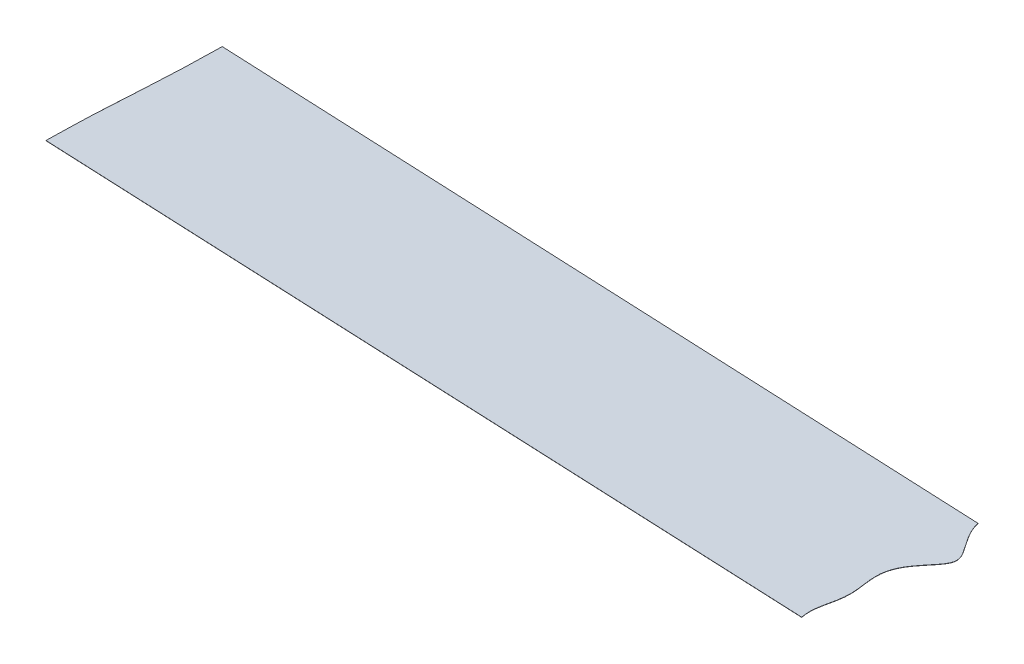
ISO-10303-21;
HEADER;
FILE_DESCRIPTION(('STEP AP214'),'2;1');
FILE_NAME('part.step','',(''),(''),'','','');
FILE_SCHEMA(('AUTOMOTIVE_DESIGN { 1 0 10303 214 1 1 1 1 }'));
ENDSEC;
DATA;
#1=APPLICATION_CONTEXT('core data for automotive mechanical design processes');
#2=APPLICATION_PROTOCOL_DEFINITION('international standard','automotive_design',2000,#1);
#3=PRODUCT_CONTEXT('',#1,'mechanical');
#4=PRODUCT('Part','Part','',(#3));
#5=PRODUCT_RELATED_PRODUCT_CATEGORY('part','',(#4));
#6=PRODUCT_DEFINITION_FORMATION('','',#4);
#7=PRODUCT_DEFINITION_CONTEXT('part definition',#1,'design');
#8=PRODUCT_DEFINITION('design','',#6,#7);
#9=PRODUCT_DEFINITION_SHAPE('','',#8);
#10=(LENGTH_UNIT() NAMED_UNIT(*) SI_UNIT(.MILLI.,.METRE.));
#11=(NAMED_UNIT(*) PLANE_ANGLE_UNIT() SI_UNIT($,.RADIAN.));
#12=(NAMED_UNIT(*) SI_UNIT($,.STERADIAN.) SOLID_ANGLE_UNIT());
#13=UNCERTAINTY_MEASURE_WITH_UNIT(LENGTH_MEASURE(1.E-05),#10,'distance_accuracy_value','');
#14=(GEOMETRIC_REPRESENTATION_CONTEXT(3) GLOBAL_UNCERTAINTY_ASSIGNED_CONTEXT((#13)) GLOBAL_UNIT_ASSIGNED_CONTEXT((#10,
#11,#12)) REPRESENTATION_CONTEXT('',''));
#15=CARTESIAN_POINT('',(0.,0.,0.));
#16=DIRECTION('',(0.,0.,1.));
#17=DIRECTION('',(1.,0.,0.));
#18=AXIS2_PLACEMENT_3D('',#15,#16,#17);
#19=CARTESIAN_POINT('',(316.362576597848,255.144627916635,100.64597502899));
#20=CARTESIAN_POINT('',(316.344710583443,255.14143360713,101.457326488308));
#21=CARTESIAN_POINT('',(316.335214662001,255.139744631227,101.886322516267));
#22=CARTESIAN_POINT('',(316.32001362776,255.137040925149,102.573057695165));
#23=CARTESIAN_POINT('',(316.307578392178,255.13486134582,103.126657867964));
#24=CARTESIAN_POINT('',(316.27675304594,255.129458449589,104.498961343194));
#25=CARTESIAN_POINT('',(316.250443633011,255.125094775006,105.60724619325));
#26=CARTESIAN_POINT('',(316.219215404637,255.119915266561,106.922736299201));
#27=CARTESIAN_POINT('',(316.189159999789,255.115328204191,108.087650986793));
#28=CARTESIAN_POINT('',(316.155897840989,255.110251726342,109.376855957463));
#29=CARTESIAN_POINT('',(316.08550517047,255.100548229506,111.840821465217));
#30=CARTESIAN_POINT('',(316.006679566881,255.090827137397,114.308887464379));
#31=CARTESIAN_POINT('',(315.918308542564,255.081097362405,116.77873879979));
#32=CARTESIAN_POINT('',(315.819621351817,255.071363438786,119.249188557272));
#33=CARTESIAN_POINT('',(315.710236467834,255.061628288276,121.719477018682));
#34=CARTESIAN_POINT('',(315.590186214425,255.051894415446,124.188968835647));
#35=CARTESIAN_POINT('',(315.459926250106,255.042164762404,126.65693614463));
#36=CARTESIAN_POINT('',(315.320337650449,255.032443912448,129.122252633977));
#37=CARTESIAN_POINT('',(315.172742330321,255.022740922518,131.582674086073));
#38=CARTESIAN_POINT('',(315.091943922534,255.017662496047,132.870271648819));
#39=CARTESIAN_POINT('',(315.01901416457,255.013078638228,134.032474979017));
#40=CARTESIAN_POINT('',(314.933865648423,255.007895925233,135.346394584468));
#41=CARTESIAN_POINT('',(314.862300912159,255.003540012701,136.450704022768));
#42=CARTESIAN_POINT('',(314.771677585473,254.998129354419,137.822335717369));
#43=CARTESIAN_POINT('',(314.735297383804,254.995957277464,138.372969196527));
#44=CARTESIAN_POINT('',(314.689667918474,254.993246069011,139.060265779292));
#45=CARTESIAN_POINT('',(314.662266297895,254.991617921393,139.473004347441));
#46=CARTESIAN_POINT('',(314.552527023636,254.985107905405,141.123298191723));
#47=CARTESIAN_POINT('',(314.52512102717,254.983479498197,141.53610256584));
#48=CARTESIAN_POINT('',(314.479497906516,254.980768667427,142.223303404893));
#49=CARTESIAN_POINT('',(314.443111360168,254.97859621279,142.774032627762));
#50=CARTESIAN_POINT('',(314.352494323637,254.973185932865,144.14556840453));
#51=CARTESIAN_POINT('',(314.280923297219,254.968829641975,145.249973760664));
#52=CARTESIAN_POINT('',(314.195781059996,254.963647316516,146.563795114467));
#53=CARTESIAN_POINT('',(314.122845023109,254.959063071161,147.726096696313));
#54=CARTESIAN_POINT('',(314.04205269231,254.953985034528,149.013595412941));
#55=CARTESIAN_POINT('',(313.89445709042,254.944282046079,151.474016476018));
#56=CARTESIAN_POINT('',(313.754868138488,254.934561196663,153.939332812715));
#57=CARTESIAN_POINT('',(313.62460777747,254.924831543796,156.40730005944));
#58=CARTESIAN_POINT('',(313.504557108276,254.915097671731,158.876791663719));
#59=CARTESIAN_POINT('',(313.449316007366,254.910181285858,160.124321549132));
#60=CARTESIAN_POINT('',(313.394195195808,254.905270749604,161.370369510993));
#61=CARTESIAN_POINT('',(313.295724368779,254.895549080984,163.837713049801));
#62=CARTESIAN_POINT('',(313.207538145016,254.885831470008,166.304479902212));
#63=CARTESIAN_POINT('',(313.128866808325,254.8761225377,168.769461139802));
#64=CARTESIAN_POINT('',(313.058600006772,254.866431183208,171.230345067797));
#65=CARTESIAN_POINT('',(313.025388048964,254.861360590841,172.518055896475));
#66=CARTESIAN_POINT('',(312.995383847064,254.856779738425,173.68139399046));
#67=CARTESIAN_POINT('',(312.964197521292,254.851606277419,174.995348410492));
#68=CARTESIAN_POINT('',(312.937928184973,254.84724848971,176.102138316352));
#69=CARTESIAN_POINT('',(312.90714062254,254.841851963996,177.472823781859));
#70=CARTESIAN_POINT('',(312.894723696858,254.839675492284,178.025634664316));
#71=CARTESIAN_POINT('',(312.879539826504,254.836974807285,178.711602503696));
#72=CARTESIAN_POINT('',(312.870056986733,254.835288138306,179.140012583378));
#73=CARTESIAN_POINT('',(312.852212347794,254.832097650574,179.950393316141));
#74=B_SPLINE_CURVE_WITH_KNOTS('',2,(#19,#20,#21,#22,#23,#24,#25,#26,#27,#28,#29,#30,#31,#32,#33,
#34,#35,#36,#37,#38,#39,#40,#41,#42,#43,#44,#45,#46,#47,#48,#49,#50,#51,#52,#53,#54,#55,#56,#57,
#58,#59,#60,#61,#62,#63,#64,#65,#66,#67,#68,#69,#70,#71,#72,#73),.UNSPECIFIED.,.F.,.F.,(3,2,2,2,
2,1,1,1,1,1,1,1,1,1,2,2,2,2,1,2,2,2,2,1,1,1,1,1,1,1,1,1,1,2,2,2,2,3),(0.,0.015625,0.03125,
0.0625,0.09375,0.125,0.15625,0.1875,0.21875,0.25,0.28125,0.3125,0.34375,0.375,0.40625,0.4375,
0.46875,0.484375,0.5,0.515625,0.53125,0.5625,0.59375,0.625,0.65625,0.6875,0.71875,0.75,
0.750313758850098,0.781524538993835,0.812735319137573,0.843946099281311,0.875156879425049,
0.906367659568787,0.937578439712524,0.968789219856262,0.984394609928131,1.),.UNSPECIFIED.);
#75=DIRECTION('',(0.000173989366437932,-0.999992249954468,-0.0039331614129662));
#76=VECTOR('',#75,1.);
#77=SURFACE_OF_LINEAR_EXTRUSION('',#74,#76);
#78=CARTESIAN_POINT('',(316.362593996785,255.044628691639,100.645581712849));
#79=CARTESIAN_POINT('',(316.34472798238,255.041434382134,101.456933172167));
#80=CARTESIAN_POINT('',(316.335232060938,255.039745406232,101.885929200126));
#81=CARTESIAN_POINT('',(316.320031026696,255.037041700153,102.572664379024));
#82=CARTESIAN_POINT('',(316.307595791114,255.034862120825,103.126264551823));
#83=CARTESIAN_POINT('',(316.276770444877,255.029459224594,104.498568027052));
#84=CARTESIAN_POINT('',(316.250461031948,255.02509555001,105.606852877109));
#85=CARTESIAN_POINT('',(316.219232803574,255.019916041565,106.922342983059));
#86=CARTESIAN_POINT('',(316.189177398726,255.015328979196,108.087257670652));
#87=CARTESIAN_POINT('',(316.155915239925,255.010252501347,109.376462641322));
#88=CARTESIAN_POINT('',(316.085522569407,255.00054900451,111.840428149075));
#89=CARTESIAN_POINT('',(316.006696965818,254.990827912402,114.308494148238));
#90=CARTESIAN_POINT('',(315.918325941501,254.981098137409,116.778345483649));
#91=CARTESIAN_POINT('',(315.819638750754,254.97136421379,119.24879524113));
#92=CARTESIAN_POINT('',(315.71025386677,254.96162906328,121.71908370254));
#93=CARTESIAN_POINT('',(315.590203613362,254.951895190451,124.188575519506));
#94=CARTESIAN_POINT('',(315.459943649043,254.942165537409,126.656542828488));
#95=CARTESIAN_POINT('',(315.320355049385,254.932444687453,129.121859317836));
#96=CARTESIAN_POINT('',(315.172759729258,254.922741697523,131.582280769932));
#97=CARTESIAN_POINT('',(315.091961321471,254.917663271052,132.869878332677));
#98=CARTESIAN_POINT('',(315.019031563506,254.913079413232,134.032081662876));
#99=CARTESIAN_POINT('',(314.93388304736,254.907896700238,135.346001268327));
#100=CARTESIAN_POINT('',(314.862318311096,254.903540787705,136.450310706627));
#101=CARTESIAN_POINT('',(314.77169498441,254.898130129423,137.821942401228));
#102=CARTESIAN_POINT('',(314.735314782741,254.895958052468,138.372575880386));
#103=CARTESIAN_POINT('',(314.68968531741,254.893246844016,139.059872463151));
#104=CARTESIAN_POINT('',(314.662283696831,254.891618696397,139.472611031299));
#105=CARTESIAN_POINT('',(314.552544422572,254.885108680409,141.122904875581));
#106=CARTESIAN_POINT('',(314.525138426106,254.883480273202,141.535709249698));
#107=CARTESIAN_POINT('',(314.479515305452,254.880769442432,142.222910088752));
#108=CARTESIAN_POINT('',(314.443128759105,254.878596987794,142.773639311621));
#109=CARTESIAN_POINT('',(314.352511722573,254.87318670787,144.145175088389));
#110=CARTESIAN_POINT('',(314.280940696155,254.86883041698,145.249580444523));
#111=CARTESIAN_POINT('',(314.195798458933,254.863648091521,146.563401798326));
#112=CARTESIAN_POINT('',(314.122862422046,254.859063846166,147.725703380172));
#113=CARTESIAN_POINT('',(314.042070091247,254.853985809533,149.013202096799));
#114=CARTESIAN_POINT('',(313.894474489357,254.844282821084,151.473623159877));
#115=CARTESIAN_POINT('',(313.754885537425,254.834561971667,153.938939496574));
#116=CARTESIAN_POINT('',(313.624625176407,254.824832318801,156.406906743299));
#117=CARTESIAN_POINT('',(313.504574507213,254.815098446736,158.876398347578));
#118=CARTESIAN_POINT('',(313.449333406303,254.810182060862,160.123928232991));
#119=CARTESIAN_POINT('',(313.394212594745,254.805271524608,161.369976194852));
#120=CARTESIAN_POINT('',(313.295741767716,254.795549855989,163.83731973366));
#121=CARTESIAN_POINT('',(313.207555543953,254.785832245013,166.30408658607));
#122=CARTESIAN_POINT('',(313.128884207261,254.776123312705,168.769067823661));
#123=CARTESIAN_POINT('',(313.058617405709,254.766431958213,171.229951751656));
#124=CARTESIAN_POINT('',(313.025405447901,254.761361365845,172.517662580334));
#125=CARTESIAN_POINT('',(312.995401246,254.75678051343,173.681000674319));
#126=CARTESIAN_POINT('',(312.964214920228,254.751607052423,174.994955094351));
#127=CARTESIAN_POINT('',(312.93794558391,254.747249264715,176.101745000211));
#128=CARTESIAN_POINT('',(312.907158021477,254.741852739001,177.472430465718));
#129=CARTESIAN_POINT('',(312.894741095795,254.739676267288,178.025241348175));
#130=CARTESIAN_POINT('',(312.879557225441,254.73697558229,178.711209187555));
#131=CARTESIAN_POINT('',(312.87007438567,254.73528891331,179.139619267237));
#132=CARTESIAN_POINT('',(312.852229746731,254.732098425579,179.95));
#133=B_SPLINE_CURVE_WITH_KNOTS('',2,(#78,#79,#80,#81,#82,#83,#84,#85,#86,#87,#88,#89,#90,#91,
#92,#93,#94,#95,#96,#97,#98,#99,#100,#101,#102,#103,#104,#105,#106,#107,#108,#109,#110,#111,
#112,#113,#114,#115,#116,#117,#118,#119,#120,#121,#122,#123,#124,#125,#126,#127,#128,#129,#130,
#131,#132),.UNSPECIFIED.,.F.,.F.,(3,2,2,2,2,1,1,1,1,1,1,1,1,1,2,2,2,2,1,2,2,2,2,1,1,1,1,1,1,1,1,
1,1,2,2,2,2,3),(0.,0.015625,0.03125,0.0625,0.09375,0.125,0.15625,0.1875,0.21875,0.25,0.28125,
0.3125,0.34375,0.375,0.40625,0.4375,0.46875,0.484375,0.5,0.515625,0.53125,0.5625,0.59375,0.625,
0.65625,0.6875,0.71875,0.75,0.750313758850098,0.781524538993835,0.812735319137573,
0.843946099281311,0.875156879425049,0.906367659568787,0.937578439712524,0.968789219856262,
0.984394609928131,1.),.UNSPECIFIED.);
#134=CARTESIAN_POINT('',(316.362593996785,255.044628691639,100.645581712849));
#135=VERTEX_POINT('',#134);
#136=CARTESIAN_POINT('',(312.852229746731,254.732098425579,179.95));
#137=VERTEX_POINT('',#136);
#138=EDGE_CURVE('E118',#135,#137,#133,.T.);
#139=ORIENTED_EDGE('',*,*,#138,.T.);
#140=DIRECTION('',(0.000173989366437932,-0.999992249954468,-0.0039331614129662));
#141=VECTOR('',#140,1.);
#142=CARTESIAN_POINT('',(312.852212347794,254.832097650574,179.950393316141));
#143=LINE('',#142,#141);
#144=CARTESIAN_POINT('',(312.852212347794,254.832097650574,179.950393316141));
#145=VERTEX_POINT('',#144);
#146=EDGE_CURVE('E13',#145,#137,#143,.T.);
#147=ORIENTED_EDGE('',*,*,#146,.F.);
#148=CARTESIAN_POINT('',(316.362576597848,255.144627916634,100.64597502899));
#149=VERTEX_POINT('',#148);
#150=EDGE_CURVE('E88',#149,#145,#74,.T.);
#151=ORIENTED_EDGE('',*,*,#150,.F.);
#152=DIRECTION('',(0.000173989366437932,-0.999992249954468,-0.0039331614129662));
#153=VECTOR('',#152,1.);
#154=CARTESIAN_POINT('',(316.362576597848,255.144627916634,100.64597502899));
#155=LINE('',#154,#153);
#156=EDGE_CURVE('E55',#149,#135,#155,.T.);
#157=ORIENTED_EDGE('',*,*,#156,.T.);
#158=EDGE_LOOP('',(#139,#147,#151,#157));
#159=FACE_BOUND('',#158,.T.);
#160=ADVANCED_FACE('F38',(#159),#77,.F.);
#161=CARTESIAN_POINT('',(312.852212347793,254.832097650574,179.950393316141));
#162=DIRECTION('',(0.0441929565756619,0.003937007874018,-0.999015256419091));
#163=DIRECTION('',(-0.999022998892819,0.,-0.0441932990757419));
#164=AXIS2_PLACEMENT_3D('',#161,#162,#163);
#165=PLANE('',#164);
#166=DIRECTION('',(0.999022998892819,0.,0.0441932990757419));
#167=VECTOR('',#166,1.);
#168=CARTESIAN_POINT('',(312.852229746729,254.732098425578,179.95));
#169=LINE('',#168,#167);
#170=CARTESIAN_POINT('',(684.358801291535,254.732098425579,196.384157214677));
#171=VERTEX_POINT('',#170);
#172=EDGE_CURVE('E93',#137,#171,#169,.T.);
#173=ORIENTED_EDGE('',*,*,#172,.T.);
#174=DIRECTION('',(0.000173989366437932,-0.999992249954468,-0.0039331614129662));
#175=VECTOR('',#174,1.);
#176=CARTESIAN_POINT('',(684.358783892598,254.832097650574,196.384550530818));
#177=LINE('',#176,#175);
#178=CARTESIAN_POINT('',(684.358783892598,254.832097650574,196.384550530818));
#179=VERTEX_POINT('',#178);
#180=EDGE_CURVE('E47',#179,#171,#177,.T.);
#181=ORIENTED_EDGE('',*,*,#180,.F.);
#182=DIRECTION('',(0.999022998892819,0.,0.0441932990757419));
#183=VECTOR('',#182,1.);
#184=CARTESIAN_POINT('',(312.852212347793,254.832097650574,179.950393316141));
#185=LINE('',#184,#183);
#186=EDGE_CURVE('E81',#145,#179,#185,.T.);
#187=ORIENTED_EDGE('',*,*,#186,.F.);
#188=ORIENTED_EDGE('',*,*,#146,.T.);
#189=EDGE_LOOP('',(#173,#181,#187,#188));
#190=FACE_BOUND('',#189,.T.);
#191=ADVANCED_FACE('F92',(#190),#165,.F.);
#192=CARTESIAN_POINT('',(684.358783892598,254.832097650574,196.384550530818));
#193=CARTESIAN_POINT('',(684.081626949486,254.837202050486,195.074514615032));
#194=CARTESIAN_POINT('',(683.950907738714,254.845024241465,193.079967916802));
#195=CARTESIAN_POINT('',(683.953080292159,254.849011214034,192.066390478921));
#196=CARTESIAN_POINT('',(683.976192293171,254.85164835888,191.396928209467));
#197=CARTESIAN_POINT('',(684.039059538964,254.85549172136,190.42254804557));
#198=CARTESIAN_POINT('',(684.158989372595,254.859526312862,189.402072836001));
#199=CARTESIAN_POINT('',(684.25385960667,254.862173950506,188.733117144316));
#200=CARTESIAN_POINT('',(684.362033648121,254.864813509979,188.066803813185));
#201=CARTESIAN_POINT('',(684.479738981381,254.867398576936,187.414766640674));
#202=CARTESIAN_POINT('',(684.607369457897,254.869996443489,186.759914270709));
#203=CARTESIAN_POINT('',(684.739176134676,254.872523448066,186.123263045313));
#204=CARTESIAN_POINT('',(684.84787463151,254.874528426554,185.618312864526));
#205=CARTESIAN_POINT('',(684.921303383171,254.875862476849,185.282383571174));
#206=CARTESIAN_POINT('',(685.000155685505,254.877279453384,184.925610496399));
#207=CARTESIAN_POINT('',(685.050872288992,254.878183692358,184.697954490707));
#208=CARTESIAN_POINT('',(685.091691676037,254.87890926732,184.51528535415));
#209=CARTESIAN_POINT('',(685.139127569389,254.879752923312,184.302887228392));
#210=CARTESIAN_POINT('',(685.199536198262,254.880828262749,184.032158282381));
#211=CARTESIAN_POINT('',(685.240286444538,254.881554661727,183.849276584172));
#212=CARTESIAN_POINT('',(685.346835885907,254.883461851828,183.369093684803));
#213=CARTESIAN_POINT('',(685.442495856836,254.885206466986,182.929763172203));
#214=CARTESIAN_POINT('',(685.508302995454,254.886423358982,182.623283804606));
#215=CARTESIAN_POINT('',(685.616107886851,254.888458525961,182.110618777816));
#216=CARTESIAN_POINT('',(685.745846016245,254.891031761597,181.462121965401));
#217=CARTESIAN_POINT('',(685.868233157217,254.893631688751,180.806513747862));
#218=CARTESIAN_POINT('',(686.038675983985,254.897581748312,179.809765001276));
#219=CARTESIAN_POINT('',(686.213492381408,254.902788067525,178.493810194142));
#220=CARTESIAN_POINT('',(686.324362849139,254.907798266917,177.224889405851));
#221=CARTESIAN_POINT('',(686.382667715147,254.912992160312,175.906939753835));
#222=CARTESIAN_POINT('',(686.371623375879,254.918462370779,174.515669705208));
#223=CARTESIAN_POINT('',(686.30359620233,254.923671877775,173.188161861334));
#224=CARTESIAN_POINT('',(686.187986174681,254.928847007868,171.867289322473));
#225=CARTESIAN_POINT('',(686.106951526761,254.931632355053,171.155540052203));
#226=CARTESIAN_POINT('',(686.04127731187,254.933889728835,170.578705627381));
#227=CARTESIAN_POINT('',(685.901344432743,254.938137585048,169.492513204409));
#228=CARTESIAN_POINT('',(685.813036142492,254.940747152359,168.825133578905));
#229=CARTESIAN_POINT('',(685.663034000322,254.945203751925,167.685423474543));
#230=CARTESIAN_POINT('',(685.599367152426,254.947247519171,167.16298654761));
#231=CARTESIAN_POINT('',(685.511146411618,254.950079490071,166.43906547654));
#232=CARTESIAN_POINT('',(685.450941425028,254.952440711069,165.836070207275));
#233=CARTESIAN_POINT('',(685.380203549374,254.955215028725,165.127580648634));
#234=CARTESIAN_POINT('',(685.292987825524,254.960421690291,163.799947410493));
#235=CARTESIAN_POINT('',(685.265619031528,254.965635942749,162.473031635088));
#236=CARTESIAN_POINT('',(685.334662056966,254.973632693662,160.442940482715));
#237=CARTESIAN_POINT('',(685.773220679927,254.983979486691,157.831705594065));
#238=CARTESIAN_POINT('',(686.582326140068,254.994067036519,155.302774066016));
#239=CARTESIAN_POINT('',(687.722993700737,255.00374206944,152.89339064172));
#240=CARTESIAN_POINT('',(688.457235979271,255.008578077705,151.696333124379));
#241=CARTESIAN_POINT('',(689.114476636237,255.012906923021,150.624813692543));
#242=CARTESIAN_POINT('',(690.330137942866,255.019690649904,148.953851970516));
#243=CARTESIAN_POINT('',(691.143419969397,255.023974426902,147.900693724642));
#244=CARTESIAN_POINT('',(691.587831423881,255.026219580718,147.349530596505));
#245=CARTESIAN_POINT('',(691.963228618738,255.028116076489,146.883959580902));
#246=CARTESIAN_POINT('',(692.431890021078,255.030423052973,146.318150993144));
#247=CARTESIAN_POINT('',(692.708918848546,255.031786721898,145.983697827478));
#248=CARTESIAN_POINT('',(693.85884872043,255.037397558653,144.608031503834));
#249=CARTESIAN_POINT('',(694.147111139298,255.038821012557,144.25887515535));
#250=CARTESIAN_POINT('',(694.633198195743,255.041221334185,143.670104748372));
#251=CARTESIAN_POINT('',(694.994529843517,255.043077658052,143.214125085231));
#252=CARTESIAN_POINT('',(695.452558208915,255.04543075663,142.63611975121));
#253=CARTESIAN_POINT('',(695.80869554278,255.047412052127,142.148136718833));
#254=CARTESIAN_POINT('',(696.240858721073,255.049816301494,141.555982293638));
#255=CARTESIAN_POINT('',(696.56763654904,255.051919631683,141.035673614115));
#256=CARTESIAN_POINT('',(696.954784889395,255.054411541238,140.419240599057));
#257=CARTESIAN_POINT('',(697.221327371385,255.05665604167,139.860375287202));
#258=CARTESIAN_POINT('',(697.531223225487,255.059265612097,139.210610034587));
#259=CARTESIAN_POINT('',(697.87735443437,255.064355484058,137.931839896328));
#260=CARTESIAN_POINT('',(697.913373719888,255.069527962516,136.618349079097));
#261=CARTESIAN_POINT('',(697.64454205934,255.074586561623,135.32032613603));
#262=CARTESIAN_POINT('',(697.380093735031,255.077179425571,134.649401459127));
#263=CARTESIAN_POINT('',(697.154192897317,255.079394338975,134.076274565805));
#264=CARTESIAN_POINT('',(696.816812353904,255.081862381499,133.433859023201));
#265=CARTESIAN_POINT('',(696.531728476219,255.083947857815,132.891022995624));
#266=CARTESIAN_POINT('',(696.149449116869,255.086341682358,132.265490942459));
#267=CARTESIAN_POINT('',(695.836518620089,255.088301245921,131.753435945612));
#268=CARTESIAN_POINT('',(695.430102680472,255.090643366376,131.139981753771));
#269=CARTESIAN_POINT('',(695.114220960562,255.092463750288,130.663182134675));
#270=CARTESIAN_POINT('',(694.682208552464,255.094855931252,130.035867938584));
#271=CARTESIAN_POINT('',(694.456225008149,255.096107269229,129.707722999281));
#272=CARTESIAN_POINT('',(693.429371028868,255.101734211769,128.231668498988));
#273=CARTESIAN_POINT('',(693.154655097603,255.103258295553,127.832023160821));
#274=CARTESIAN_POINT('',(692.740894420138,255.10555377924,127.230101295192));
#275=CARTESIAN_POINT('',(692.015858894314,255.109704687285,126.142674694061));
#276=CARTESIAN_POINT('',(691.307226368117,255.113965577814,125.028011050647));
#277=CARTESIAN_POINT('',(690.251846575651,255.120751280706,123.256083984166));
#278=CARTESIAN_POINT('',(689.695576917943,255.125107410027,122.123946220728));
#279=CARTESIAN_POINT('',(689.080228158874,255.129926185839,120.871568784394));
#280=CARTESIAN_POINT('',(688.172453012354,255.139616197227,118.36776116531));
#281=CARTESIAN_POINT('',(687.892924008491,255.144627916635,117.08118400519));
#282=B_SPLINE_CURVE_WITH_KNOTS('',2,(#192,#193,#194,#195,#196,#197,#198,#199,#200,#201,#202,
#203,#204,#205,#206,#207,#208,#209,#210,#211,#212,#213,#214,#215,#216,#217,#218,#219,#220,#221,
#222,#223,#224,#225,#226,#227,#228,#229,#230,#231,#232,#233,#234,#235,#236,#237,#238,#239,#240,
#241,#242,#243,#244,#245,#246,#247,#248,#249,#250,#251,#252,#253,#254,#255,#256,#257,#258,#259,
#260,#261,#262,#263,#264,#265,#266,#267,#268,#269,#270,#271,#272,#273,#274,#275,#276,#277,#278,
#279,#280,#281),.UNSPECIFIED.,.F.,.F.,(3,1,1,1,1,1,1,1,1,1,1,1,1,1,1,1,1,1,1,1,1,1,1,1,1,1,1,1,
1,1,1,1,2,1,1,1,2,2,1,1,1,1,1,1,2,1,1,2,2,1,2,2,2,2,2,1,1,1,2,2,2,2,2,1,2,1,1,1,2,1,3),(0.,
0.03125,0.046875,0.0546875,0.0625,0.078125,0.0859375,0.09375,0.1015625,0.109375,0.1171875,0.125,
0.12890625,0.1328125,0.13671875,0.138671875,0.140625,0.14375,0.14609375,0.1484375,0.15625,
0.16015625,0.1640625,0.171875,0.1796875,0.1875,0.203125,0.21875,0.232912063598633,0.25,0.265625,
0.28125,0.296875,0.3125,0.3203125,0.328125,0.34375,0.359375,0.375,0.390625,0.40625,0.4375,
0.46875,0.5,0.53125,0.5625,0.578125,0.59375,0.609375,0.625,0.640625,0.65625,0.671875,0.6875,
0.703125,0.71875,0.734375,0.75,0.765625,0.78125,0.796875,0.8125,0.828125,0.84375,0.859375,0.875,
0.890625,0.90625,0.9375,0.96875,1.),.UNSPECIFIED.);
#283=DIRECTION('',(0.000173989366437932,-0.999992249954468,-0.0039331614129662));
#284=VECTOR('',#283,1.);
#285=SURFACE_OF_LINEAR_EXTRUSION('',#282,#284);
#286=CARTESIAN_POINT('',(684.358801291535,254.732098425579,196.384157214677));
#287=CARTESIAN_POINT('',(684.081644348423,254.737202825491,195.07412129889));
#288=CARTESIAN_POINT('',(683.950925137651,254.74502501647,193.079574600661));
#289=CARTESIAN_POINT('',(683.953097691095,254.749011989038,192.065997162779));
#290=CARTESIAN_POINT('',(683.976209692108,254.751649133884,191.396534893326));
#291=CARTESIAN_POINT('',(684.0390769379,254.755492496365,190.422154729429));
#292=CARTESIAN_POINT('',(684.159006771531,254.759527087866,189.40167951986));
#293=CARTESIAN_POINT('',(684.253877005606,254.762174725511,188.732723828175));
#294=CARTESIAN_POINT('',(684.362051047058,254.764814284984,188.066410497044));
#295=CARTESIAN_POINT('',(684.479756380318,254.767399351941,187.414373324533));
#296=CARTESIAN_POINT('',(684.607386856834,254.769997218493,186.759520954568));
#297=CARTESIAN_POINT('',(684.739193533612,254.772524223071,186.122869729172));
#298=CARTESIAN_POINT('',(684.847892030447,254.774529201559,185.617919548385));
#299=CARTESIAN_POINT('',(684.921320782107,254.775863251854,185.281990255033));
#300=CARTESIAN_POINT('',(685.000173084442,254.777280228388,184.925217180258));
#301=CARTESIAN_POINT('',(685.050889687929,254.778184467363,184.697561174565));
#302=CARTESIAN_POINT('',(685.091709074973,254.778910042325,184.514892038008));
#303=CARTESIAN_POINT('',(685.139144968325,254.779753698317,184.30249391225));
#304=CARTESIAN_POINT('',(685.199553597199,254.780829037753,184.03176496624));
#305=CARTESIAN_POINT('',(685.240303843475,254.781555436731,183.848883268031));
#306=CARTESIAN_POINT('',(685.346853284844,254.783462626833,183.368700368662));
#307=CARTESIAN_POINT('',(685.442513255773,254.785207241991,182.929369856062));
#308=CARTESIAN_POINT('',(685.50832039439,254.786424133987,182.622890488465));
#309=CARTESIAN_POINT('',(685.616125285787,254.788459300965,182.110225461675));
#310=CARTESIAN_POINT('',(685.745863415181,254.791032536602,181.46172864926));
#311=CARTESIAN_POINT('',(685.868250556153,254.793632463756,180.806120431721));
#312=CARTESIAN_POINT('',(686.038693382921,254.797582523317,179.809371685134));
#313=CARTESIAN_POINT('',(686.213509780345,254.802788842529,178.493416878001));
#314=CARTESIAN_POINT('',(686.324380248076,254.807799041921,177.22449608971));
#315=CARTESIAN_POINT('',(686.382685114083,254.812992935317,175.906546437694));
#316=CARTESIAN_POINT('',(686.371640774816,254.818463145784,174.515276389067));
#317=CARTESIAN_POINT('',(686.303613601267,254.82367265278,173.187768545193));
#318=CARTESIAN_POINT('',(686.188003573618,254.828847782873,171.866896006332));
#319=CARTESIAN_POINT('',(686.106968925698,254.831633130058,171.155146736062));
#320=CARTESIAN_POINT('',(686.041294710807,254.833890503839,170.578312311239));
#321=CARTESIAN_POINT('',(685.901361831679,254.838138360052,169.492119888267));
#322=CARTESIAN_POINT('',(685.813053541428,254.840747927364,168.824740262764));
#323=CARTESIAN_POINT('',(685.663051399259,254.84520452693,167.685030158402));
#324=CARTESIAN_POINT('',(685.599384551363,254.847248294176,167.162593231468));
#325=CARTESIAN_POINT('',(685.511163810555,254.850080265076,166.438672160399));
#326=CARTESIAN_POINT('',(685.450958823965,254.852441486073,165.835676891134));
#327=CARTESIAN_POINT('',(685.380220948311,254.85521580373,165.127187332493));
#328=CARTESIAN_POINT('',(685.293005224461,254.860422465296,163.799554094352));
#329=CARTESIAN_POINT('',(685.265636430465,254.865636717754,162.472638318947));
#330=CARTESIAN_POINT('',(685.334679455903,254.873633468666,160.442547166573));
#331=CARTESIAN_POINT('',(685.773238078864,254.883980261696,157.831312277924));
#332=CARTESIAN_POINT('',(686.582343539004,254.894067811523,155.302380749875));
#333=CARTESIAN_POINT('',(687.723011099674,254.903742844445,152.892997325579));
#334=CARTESIAN_POINT('',(688.457253378207,254.908578852709,151.695939808238));
#335=CARTESIAN_POINT('',(689.114494035174,254.912907698026,150.624420376402));
#336=CARTESIAN_POINT('',(690.330155341802,254.919691424908,148.953458654374));
#337=CARTESIAN_POINT('',(691.143437368333,254.923975201907,147.9003004085));
#338=CARTESIAN_POINT('',(691.587848822817,254.926220355722,147.349137280364));
#339=CARTESIAN_POINT('',(691.963246017675,254.928116851494,146.883566264761));
#340=CARTESIAN_POINT('',(692.431907420014,254.930423827978,146.317757677003));
#341=CARTESIAN_POINT('',(692.708936247482,254.931787496902,145.983304511337));
#342=CARTESIAN_POINT('',(693.858866119367,254.937398333658,144.607638187693));
#343=CARTESIAN_POINT('',(694.147128538235,254.938821787562,144.258481839209));
#344=CARTESIAN_POINT('',(694.63321559468,254.941222109189,143.669711432231));
#345=CARTESIAN_POINT('',(694.994547242454,254.943078433057,143.21373176909));
#346=CARTESIAN_POINT('',(695.452575607851,254.945431531635,142.635726435068));
#347=CARTESIAN_POINT('',(695.808712941716,254.947412827132,142.147743402692));
#348=CARTESIAN_POINT('',(696.240876120009,254.949817076498,141.555588977497));
#349=CARTESIAN_POINT('',(696.567653947977,254.951920406688,141.035280297974));
#350=CARTESIAN_POINT('',(696.954802288331,254.954412316243,140.418847282915));
#351=CARTESIAN_POINT('',(697.221344770322,254.956656816675,139.859981971061));
#352=CARTESIAN_POINT('',(697.531240624424,254.959266387102,139.210216718445));
#353=CARTESIAN_POINT('',(697.877371833307,254.964356259062,137.931446580186));
#354=CARTESIAN_POINT('',(697.913391118825,254.96952873752,136.617955762956));
#355=CARTESIAN_POINT('',(697.644559458277,254.974587336627,135.319932819889));
#356=CARTESIAN_POINT('',(697.380111133967,254.977180200576,134.649008142986));
#357=CARTESIAN_POINT('',(697.154210296254,254.979395113979,134.075881249663));
#358=CARTESIAN_POINT('',(696.81682975284,254.981863156503,133.43346570706));
#359=CARTESIAN_POINT('',(696.531745875156,254.98394863282,132.890629679482));
#360=CARTESIAN_POINT('',(696.149466515805,254.986342457362,132.265097626318));
#361=CARTESIAN_POINT('',(695.836536019026,254.988302020925,131.753042629471));
#362=CARTESIAN_POINT('',(695.430120079408,254.990644141381,131.139588437629));
#363=CARTESIAN_POINT('',(695.114238359499,254.992464525292,130.662788818534));
#364=CARTESIAN_POINT('',(694.6822259514,254.994856706256,130.035474622442));
#365=CARTESIAN_POINT('',(694.456242407086,254.996108044234,129.707329683139));
#366=CARTESIAN_POINT('',(693.429388427805,255.001734986773,128.231275182847));
#367=CARTESIAN_POINT('',(693.15467249654,255.003259070557,127.83162984468));
#368=CARTESIAN_POINT('',(692.740911819075,255.005554554245,127.229707979051));
#369=CARTESIAN_POINT('',(692.01587629325,255.00970546229,126.142281377919));
#370=CARTESIAN_POINT('',(691.307243767053,255.013966352818,125.027617734506));
#371=CARTESIAN_POINT('',(690.251863974587,255.020752055711,123.255690668024));
#372=CARTESIAN_POINT('',(689.695594316879,255.025108185031,122.123552904587));
#373=CARTESIAN_POINT('',(689.080245557811,255.029926960843,120.871175468252));
#374=CARTESIAN_POINT('',(688.172470411291,255.039616972231,118.367367849169));
#375=CARTESIAN_POINT('',(687.892941407428,255.044628691639,117.080790689048));
#376=B_SPLINE_CURVE_WITH_KNOTS('',2,(#286,#287,#288,#289,#290,#291,#292,#293,#294,#295,#296,
#297,#298,#299,#300,#301,#302,#303,#304,#305,#306,#307,#308,#309,#310,#311,#312,#313,#314,#315,
#316,#317,#318,#319,#320,#321,#322,#323,#324,#325,#326,#327,#328,#329,#330,#331,#332,#333,#334,
#335,#336,#337,#338,#339,#340,#341,#342,#343,#344,#345,#346,#347,#348,#349,#350,#351,#352,#353,
#354,#355,#356,#357,#358,#359,#360,#361,#362,#363,#364,#365,#366,#367,#368,#369,#370,#371,#372,
#373,#374,#375),.UNSPECIFIED.,.F.,.F.,(3,1,1,1,1,1,1,1,1,1,1,1,1,1,1,1,1,1,1,1,1,1,1,1,1,1,1,1,
1,1,1,1,2,1,1,1,2,2,1,1,1,1,1,1,2,1,1,2,2,1,2,2,2,2,2,1,1,1,2,2,2,2,2,1,2,1,1,1,2,1,3),(0.,
0.03125,0.046875,0.0546875,0.0625,0.078125,0.0859375,0.09375,0.1015625,0.109375,0.1171875,0.125,
0.12890625,0.1328125,0.13671875,0.138671875,0.140625,0.14375,0.14609375,0.1484375,0.15625,
0.16015625,0.1640625,0.171875,0.1796875,0.1875,0.203125,0.21875,0.232912063598633,0.25,0.265625,
0.28125,0.296875,0.3125,0.3203125,0.328125,0.34375,0.359375,0.375,0.390625,0.40625,0.4375,
0.46875,0.5,0.53125,0.5625,0.578125,0.59375,0.609375,0.625,0.640625,0.65625,0.671875,0.6875,
0.703125,0.71875,0.734375,0.75,0.765625,0.78125,0.796875,0.8125,0.828125,0.84375,0.859375,0.875,
0.890625,0.90625,0.9375,0.96875,1.),.UNSPECIFIED.);
#377=CARTESIAN_POINT('',(687.892941407428,255.044628691639,117.080790689048));
#378=VERTEX_POINT('',#377);
#379=EDGE_CURVE('E121',#171,#378,#376,.T.);
#380=ORIENTED_EDGE('',*,*,#379,.T.);
#381=DIRECTION('',(0.000173989366437932,-0.999992249954468,-0.0039331614129662));
#382=VECTOR('',#381,1.);
#383=CARTESIAN_POINT('',(687.892924008491,255.144627916635,117.08118400519));
#384=LINE('',#383,#382);
#385=CARTESIAN_POINT('',(687.892924008491,255.144627916635,117.08118400519));
#386=VERTEX_POINT('',#385);
#387=EDGE_CURVE('E70',#386,#378,#384,.T.);
#388=ORIENTED_EDGE('',*,*,#387,.F.);
#389=EDGE_CURVE('E87',#179,#386,#282,.T.);
#390=ORIENTED_EDGE('',*,*,#389,.F.);
#391=ORIENTED_EDGE('',*,*,#180,.T.);
#392=EDGE_LOOP('',(#380,#388,#390,#391));
#393=FACE_BOUND('',#392,.T.);
#394=ADVANCED_FACE('F96',(#393),#285,.F.);
#395=CARTESIAN_POINT('',(316.362576597847,255.144627916634,100.64597502899));
#396=DIRECTION('',(0.0441929565756619,0.003937007874018,-0.999015256419091));
#397=DIRECTION('',(-0.999022998892819,0.,-0.0441932990757419));
#398=AXIS2_PLACEMENT_3D('',#395,#396,#397);
#399=PLANE('',#398);
#400=DIRECTION('',(0.999022998892819,0.,0.0441932990757419));
#401=VECTOR('',#400,1.);
#402=CARTESIAN_POINT('',(316.362593996784,255.044628691639,100.645581712849));
#403=LINE('',#402,#401);
#404=EDGE_CURVE('E132',#135,#378,#403,.T.);
#405=ORIENTED_EDGE('',*,*,#404,.F.);
#406=ORIENTED_EDGE('',*,*,#156,.F.);
#407=DIRECTION('',(0.999022998892819,0.,0.0441932990757419));
#408=VECTOR('',#407,1.);
#409=CARTESIAN_POINT('',(316.362576597847,255.144627916634,100.64597502899));
#410=LINE('',#409,#408);
#411=EDGE_CURVE('E97',#149,#386,#410,.T.);
#412=ORIENTED_EDGE('',*,*,#411,.T.);
#413=ORIENTED_EDGE('',*,*,#387,.T.);
#414=EDGE_LOOP('',(#405,#406,#412,#413));
#415=FACE_BOUND('',#414,.T.);
#416=ADVANCED_FACE('F110',(#415),#399,.T.);
#417=CARTESIAN_POINT('',(-3566.55380159236,240.191550845912,3730.64574468897));
#418=DIRECTION('',(-0.0001739893664403,0.999992249954468,0.00393316141296889));
#419=DIRECTION('',(0.,-0.00393316147250181,0.999992265090501));
#420=AXIS2_PLACEMENT_3D('',#417,#418,#419);
#421=PLANE('',#420);
#422=ORIENTED_EDGE('',*,*,#150,.T.);
#423=ORIENTED_EDGE('',*,*,#186,.T.);
#424=ORIENTED_EDGE('',*,*,#389,.T.);
#425=ORIENTED_EDGE('',*,*,#411,.F.);
#426=EDGE_LOOP('',(#422,#423,#424,#425));
#427=FACE_BOUND('',#426,.T.);
#428=ADVANCED_FACE('F84',(#427),#421,.T.);
#429=CARTESIAN_POINT('',(-3566.55378419342,240.091551620916,3730.64535137283));
#430=DIRECTION('',(-0.0001739893664403,0.999992249954468,0.00393316141296889));
#431=DIRECTION('',(0.,-0.00393316147250181,0.999992265090501));
#432=AXIS2_PLACEMENT_3D('',#429,#430,#431);
#433=PLANE('',#432);
#434=ORIENTED_EDGE('',*,*,#138,.F.);
#435=ORIENTED_EDGE('',*,*,#404,.T.);
#436=ORIENTED_EDGE('',*,*,#379,.F.);
#437=ORIENTED_EDGE('',*,*,#172,.F.);
#438=EDGE_LOOP('',(#434,#435,#436,#437));
#439=FACE_BOUND('',#438,.T.);
#440=ADVANCED_FACE('F144',(#439),#433,.F.);
#441=CLOSED_SHELL('',(#160,#191,#394,#416,#428,#440));
#442=MANIFOLD_SOLID_BREP('B2',#441);
#443=ADVANCED_BREP_SHAPE_REPRESENTATION('',(#18,#442),#14);
#444=SHAPE_DEFINITION_REPRESENTATION(#9,#443);
ENDSEC;
END-ISO-10303-21;
